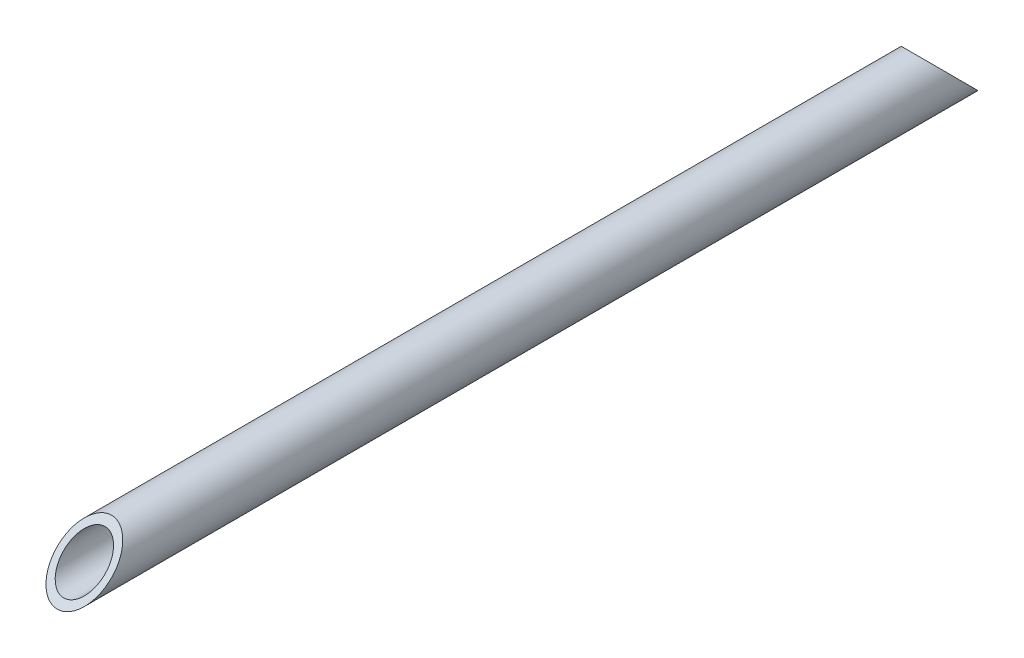
ISO-10303-21;
HEADER;
FILE_DESCRIPTION(('STEP AP214'),'2;1');
FILE_NAME('part.step','',(''),(''),'','','');
FILE_SCHEMA(('AUTOMOTIVE_DESIGN { 1 0 10303 214 1 1 1 1 }'));
ENDSEC;
DATA;
#1=APPLICATION_CONTEXT('core data for automotive mechanical design processes');
#2=APPLICATION_PROTOCOL_DEFINITION('international standard','automotive_design',2000,#1);
#3=PRODUCT_CONTEXT('',#1,'mechanical');
#4=PRODUCT('Part','Part','',(#3));
#5=PRODUCT_RELATED_PRODUCT_CATEGORY('part','',(#4));
#6=PRODUCT_DEFINITION_FORMATION('','',#4);
#7=PRODUCT_DEFINITION_CONTEXT('part definition',#1,'design');
#8=PRODUCT_DEFINITION('design','',#6,#7);
#9=PRODUCT_DEFINITION_SHAPE('','',#8);
#10=(LENGTH_UNIT() NAMED_UNIT(*) SI_UNIT(.MILLI.,.METRE.));
#11=(NAMED_UNIT(*) PLANE_ANGLE_UNIT() SI_UNIT($,.RADIAN.));
#12=(NAMED_UNIT(*) SI_UNIT($,.STERADIAN.) SOLID_ANGLE_UNIT());
#13=UNCERTAINTY_MEASURE_WITH_UNIT(LENGTH_MEASURE(1.E-05),#10,'distance_accuracy_value','');
#14=(GEOMETRIC_REPRESENTATION_CONTEXT(3) GLOBAL_UNCERTAINTY_ASSIGNED_CONTEXT((#13)) GLOBAL_UNIT_ASSIGNED_CONTEXT((#10,
#11,#12)) REPRESENTATION_CONTEXT('',''));
#15=CARTESIAN_POINT('',(0.,0.,0.));
#16=DIRECTION('',(0.,0.,1.));
#17=DIRECTION('',(1.,0.,0.));
#18=AXIS2_PLACEMENT_3D('',#15,#16,#17);
#19=CARTESIAN_POINT('',(0.,0.,200.));
#20=DIRECTION('',(0.,0.,-1.));
#21=DIRECTION('',(-1.,0.,0.));
#22=AXIS2_PLACEMENT_3D('',#19,#20,#21);
#23=CYLINDRICAL_SURFACE('',#22,9.65);
#24=CARTESIAN_POINT('',(-1.68322387278375E-13,0.,-200.000000000003));
#25=DIRECTION('',(0.,0.707106781186547,-0.707106781186548));
#26=DIRECTION('',(0.,-0.707106781186548,-0.707106781186547));
#27=AXIS2_PLACEMENT_3D('',#24,#25,#26);
#28=ELLIPSE('',#27,13.6471608769004,9.65);
#29=CARTESIAN_POINT('',(-1.76443942464556E-13,-9.65000000000001,-209.650000000003));
#30=VERTEX_POINT('',#29);
#31=EDGE_CURVE('E58',#30,#30,#28,.T.);
#32=ORIENTED_EDGE('',*,*,#31,.T.);
#33=EDGE_LOOP('',(#32));
#34=FACE_BOUND('',#33,.T.);
#35=CARTESIAN_POINT('',(0.,0.,200.));
#36=DIRECTION('',(0.,0.707106781186551,0.707106781186544));
#37=DIRECTION('',(0.,0.707106781186544,-0.707106781186551));
#38=AXIS2_PLACEMENT_3D('',#35,#36,#37);
#39=ELLIPSE('',#38,13.6471608769004,9.65);
#40=CARTESIAN_POINT('',(0.,9.65,190.35));
#41=VERTEX_POINT('',#40);
#42=EDGE_CURVE('E44',#41,#41,#39,.T.);
#43=ORIENTED_EDGE('',*,*,#42,.T.);
#44=EDGE_LOOP('',(#43));
#45=FACE_BOUND('',#44,.T.);
#46=ADVANCED_FACE('F40',(#34,#45),#23,.F.);
#47=CARTESIAN_POINT('',(0.,0.,200.));
#48=DIRECTION('',(0.,0.,-1.));
#49=DIRECTION('',(-1.,0.,0.));
#50=AXIS2_PLACEMENT_3D('',#47,#48,#49);
#51=CYLINDRICAL_SURFACE('',#50,12.7);
#52=CARTESIAN_POINT('',(-1.68322387278375E-13,0.,-200.000000000003));
#53=DIRECTION('',(0.,0.707106781186547,-0.707106781186548));
#54=DIRECTION('',(0.,-0.707106781186548,-0.707106781186547));
#55=AXIS2_PLACEMENT_3D('',#52,#53,#54);
#56=ELLIPSE('',#55,17.9605122421383,12.7);
#57=CARTESIAN_POINT('',(-1.79010858870551E-13,-12.7,-212.700000000003));
#58=VERTEX_POINT('',#57);
#59=EDGE_CURVE('E49',#58,#58,#56,.T.);
#60=ORIENTED_EDGE('',*,*,#59,.F.);
#61=EDGE_LOOP('',(#60));
#62=FACE_BOUND('',#61,.T.);
#63=CARTESIAN_POINT('',(0.,0.,200.));
#64=DIRECTION('',(0.,0.707106781186551,0.707106781186544));
#65=DIRECTION('',(0.,0.707106781186544,-0.707106781186551));
#66=AXIS2_PLACEMENT_3D('',#63,#64,#65);
#67=ELLIPSE('',#66,17.9605122421384,12.7);
#68=CARTESIAN_POINT('',(0.,12.7,187.3));
#69=VERTEX_POINT('',#68);
#70=EDGE_CURVE('E10',#69,#69,#67,.T.);
#71=ORIENTED_EDGE('',*,*,#70,.F.);
#72=EDGE_LOOP('',(#71));
#73=FACE_BOUND('',#72,.T.);
#74=ADVANCED_FACE('F74',(#62,#73),#51,.T.);
#75=CARTESIAN_POINT('',(-1.67164090169531E-13,0.,-200.000000000003));
#76=DIRECTION('',(0.,0.707106781186547,-0.707106781186548));
#77=DIRECTION('',(0.,0.707106781186548,0.707106781186547));
#78=AXIS2_PLACEMENT_3D('',#75,#76,#77);
#79=PLANE('',#78);
#80=ORIENTED_EDGE('',*,*,#31,.F.);
#81=EDGE_LOOP('',(#80));
#82=FACE_BOUND('',#81,.T.);
#83=ORIENTED_EDGE('',*,*,#59,.T.);
#84=EDGE_LOOP('',(#83));
#85=FACE_BOUND('',#84,.T.);
#86=ADVANCED_FACE('F70',(#82,#85),#79,.T.);
#87=CARTESIAN_POINT('',(0.,0.,200.));
#88=DIRECTION('',(0.,0.707106781186551,0.707106781186544));
#89=DIRECTION('',(0.,-0.707106781186544,0.707106781186551));
#90=AXIS2_PLACEMENT_3D('',#87,#88,#89);
#91=PLANE('',#90);
#92=ORIENTED_EDGE('',*,*,#42,.F.);
#93=EDGE_LOOP('',(#92));
#94=FACE_BOUND('',#93,.T.);
#95=ORIENTED_EDGE('',*,*,#70,.T.);
#96=EDGE_LOOP('',(#95));
#97=FACE_BOUND('',#96,.T.);
#98=ADVANCED_FACE('F42',(#94,#97),#91,.T.);
#99=CLOSED_SHELL('',(#46,#74,#86,#98));
#100=MANIFOLD_SOLID_BREP('B2',#99);
#101=ADVANCED_BREP_SHAPE_REPRESENTATION('',(#18,#100),#14);
#102=SHAPE_DEFINITION_REPRESENTATION(#9,#101);
ENDSEC;
END-ISO-10303-21;
